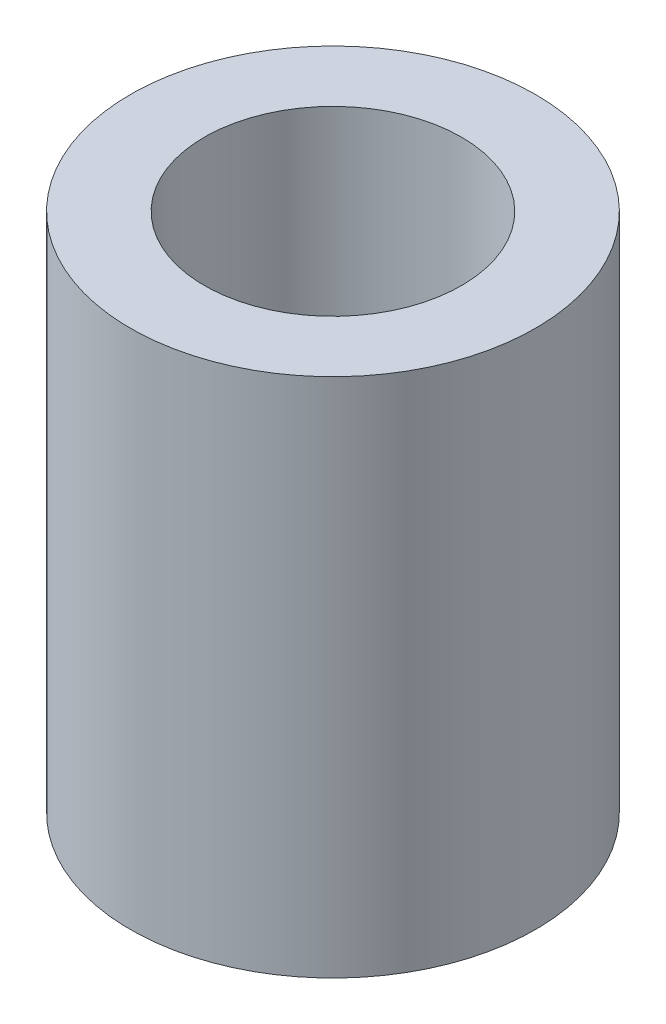
ISO-10303-21;
HEADER;
FILE_DESCRIPTION(('STEP AP214'),'2;1');
FILE_NAME('part.step','',(''),(''),'','','');
FILE_SCHEMA(('AUTOMOTIVE_DESIGN { 1 0 10303 214 1 1 1 1 }'));
ENDSEC;
DATA;
#1=APPLICATION_CONTEXT('core data for automotive mechanical design processes');
#2=APPLICATION_PROTOCOL_DEFINITION('international standard','automotive_design',2000,#1);
#3=PRODUCT_CONTEXT('',#1,'mechanical');
#4=PRODUCT('Part','Part','',(#3));
#5=PRODUCT_RELATED_PRODUCT_CATEGORY('part','',(#4));
#6=PRODUCT_DEFINITION_FORMATION('','',#4);
#7=PRODUCT_DEFINITION_CONTEXT('part definition',#1,'design');
#8=PRODUCT_DEFINITION('design','',#6,#7);
#9=PRODUCT_DEFINITION_SHAPE('','',#8);
#10=(LENGTH_UNIT() NAMED_UNIT(*) SI_UNIT(.MILLI.,.METRE.));
#11=(NAMED_UNIT(*) PLANE_ANGLE_UNIT() SI_UNIT($,.RADIAN.));
#12=(NAMED_UNIT(*) SI_UNIT($,.STERADIAN.) SOLID_ANGLE_UNIT());
#13=UNCERTAINTY_MEASURE_WITH_UNIT(LENGTH_MEASURE(1.E-05),#10,'distance_accuracy_value','');
#14=(GEOMETRIC_REPRESENTATION_CONTEXT(3) GLOBAL_UNCERTAINTY_ASSIGNED_CONTEXT((#13)) GLOBAL_UNIT_ASSIGNED_CONTEXT((#10,
#11,#12)) REPRESENTATION_CONTEXT('',''));
#15=CARTESIAN_POINT('',(0.,0.,0.));
#16=DIRECTION('',(0.,0.,1.));
#17=DIRECTION('',(1.,0.,0.));
#18=AXIS2_PLACEMENT_3D('',#15,#16,#17);
#19=CARTESIAN_POINT('',(2.,8.1,0.));
#20=DIRECTION('',(0.,1.,0.));
#21=DIRECTION('',(0.,0.,1.));
#22=AXIS2_PLACEMENT_3D('',#19,#20,#21);
#23=PLANE('',#22);
#24=CARTESIAN_POINT('',(0.,8.1,0.));
#25=DIRECTION('',(0.,-1.,0.));
#26=DIRECTION('',(0.,0.,-1.));
#27=AXIS2_PLACEMENT_3D('',#24,#25,#26);
#28=CIRCLE('',#27,2.);
#29=CARTESIAN_POINT('',(0.,8.1,-2.));
#30=VERTEX_POINT('',#29);
#31=EDGE_CURVE('E49',#30,#30,#28,.T.);
#32=ORIENTED_EDGE('',*,*,#31,.T.);
#33=EDGE_LOOP('',(#32));
#34=FACE_BOUND('',#33,.T.);
#35=CARTESIAN_POINT('',(0.,8.1,0.));
#36=DIRECTION('',(0.,-1.,0.));
#37=DIRECTION('',(0.,0.,-1.));
#38=AXIS2_PLACEMENT_3D('',#35,#36,#37);
#39=CIRCLE('',#38,3.15);
#40=CARTESIAN_POINT('',(0.,8.1,-3.15));
#41=VERTEX_POINT('',#40);
#42=EDGE_CURVE('E10',#41,#41,#39,.T.);
#43=ORIENTED_EDGE('',*,*,#42,.F.);
#44=EDGE_LOOP('',(#43));
#45=FACE_BOUND('',#44,.T.);
#46=ADVANCED_FACE('F35',(#34,#45),#23,.T.);
#47=CARTESIAN_POINT('',(0.,0.,0.));
#48=DIRECTION('',(0.,-1.,0.));
#49=DIRECTION('',(0.,0.,-1.));
#50=AXIS2_PLACEMENT_3D('',#47,#48,#49);
#51=CYLINDRICAL_SURFACE('',#50,3.15);
#52=ORIENTED_EDGE('',*,*,#42,.T.);
#53=EDGE_LOOP('',(#52));
#54=FACE_BOUND('',#53,.T.);
#55=CARTESIAN_POINT('',(0.,0.,0.));
#56=DIRECTION('',(0.,-1.,0.));
#57=DIRECTION('',(0.,0.,-1.));
#58=AXIS2_PLACEMENT_3D('',#55,#56,#57);
#59=CIRCLE('',#58,3.15);
#60=CARTESIAN_POINT('',(0.,0.,-3.15));
#61=VERTEX_POINT('',#60);
#62=EDGE_CURVE('E41',#61,#61,#59,.T.);
#63=ORIENTED_EDGE('',*,*,#62,.F.);
#64=EDGE_LOOP('',(#63));
#65=FACE_BOUND('',#64,.T.);
#66=ADVANCED_FACE('F65',(#54,#65),#51,.T.);
#67=CARTESIAN_POINT('',(3.15,0.,0.));
#68=DIRECTION('',(0.,-1.,0.));
#69=DIRECTION('',(0.,0.,-1.));
#70=AXIS2_PLACEMENT_3D('',#67,#68,#69);
#71=PLANE('',#70);
#72=ORIENTED_EDGE('',*,*,#62,.T.);
#73=EDGE_LOOP('',(#72));
#74=FACE_BOUND('',#73,.T.);
#75=CARTESIAN_POINT('',(0.,0.,0.));
#76=DIRECTION('',(0.,-1.,0.));
#77=DIRECTION('',(0.,0.,-1.));
#78=AXIS2_PLACEMENT_3D('',#75,#76,#77);
#79=CIRCLE('',#78,2.);
#80=CARTESIAN_POINT('',(0.,0.,-2.));
#81=VERTEX_POINT('',#80);
#82=EDGE_CURVE('E45',#81,#81,#79,.T.);
#83=ORIENTED_EDGE('',*,*,#82,.F.);
#84=EDGE_LOOP('',(#83));
#85=FACE_BOUND('',#84,.T.);
#86=ADVANCED_FACE('F59',(#74,#85),#71,.T.);
#87=CARTESIAN_POINT('',(0.,0.,0.));
#88=DIRECTION('',(0.,-1.,0.));
#89=DIRECTION('',(0.,0.,-1.));
#90=AXIS2_PLACEMENT_3D('',#87,#88,#89);
#91=CYLINDRICAL_SURFACE('',#90,2.);
#92=ORIENTED_EDGE('',*,*,#82,.T.);
#93=EDGE_LOOP('',(#92));
#94=FACE_BOUND('',#93,.T.);
#95=ORIENTED_EDGE('',*,*,#31,.F.);
#96=EDGE_LOOP('',(#95));
#97=FACE_BOUND('',#96,.T.);
#98=ADVANCED_FACE('F57',(#94,#97),#91,.F.);
#99=CLOSED_SHELL('',(#46,#66,#86,#98));
#100=MANIFOLD_SOLID_BREP('B2',#99);
#101=ADVANCED_BREP_SHAPE_REPRESENTATION('',(#18,#100),#14);
#102=SHAPE_DEFINITION_REPRESENTATION(#9,#101);
ENDSEC;
END-ISO-10303-21;
